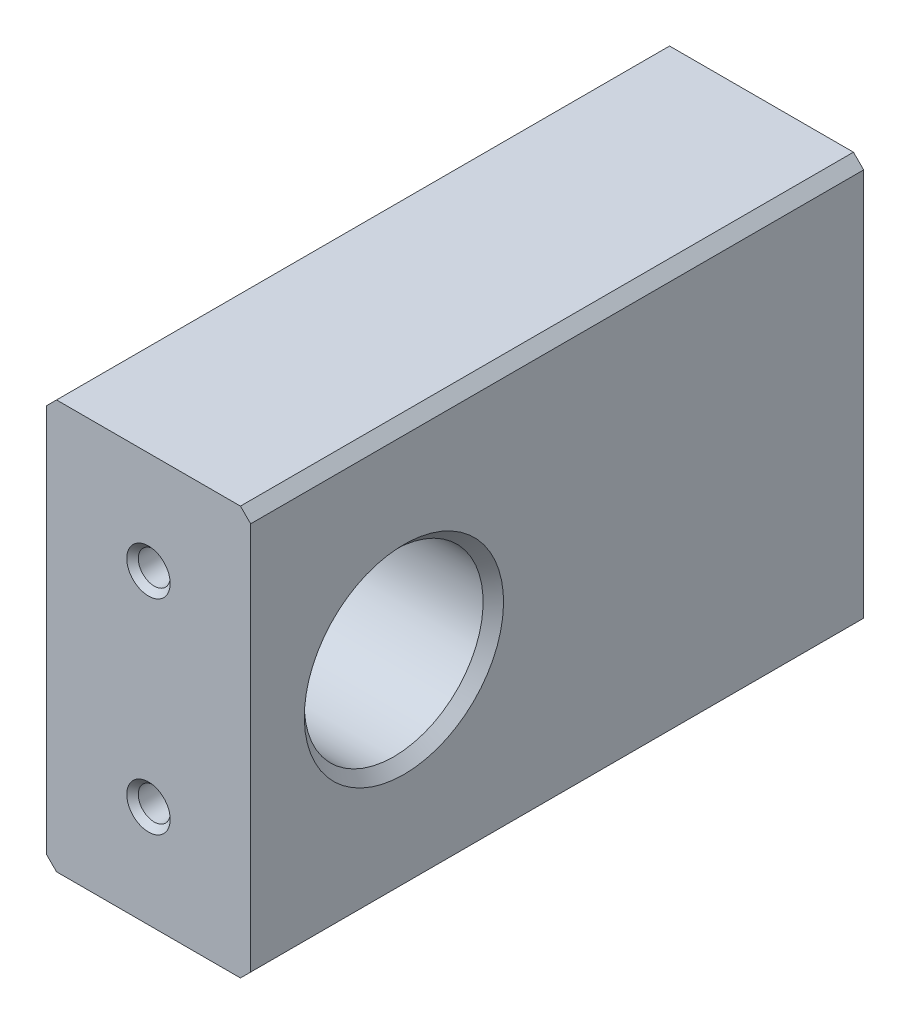
ISO-10303-21;
HEADER;
FILE_DESCRIPTION(('STEP AP214'),'2;1');
FILE_NAME('part.step','',(''),(''),'','','');
FILE_SCHEMA(('AUTOMOTIVE_DESIGN { 1 0 10303 214 1 1 1 1 }'));
ENDSEC;
DATA;
#1=APPLICATION_CONTEXT('core data for automotive mechanical design processes');
#2=APPLICATION_PROTOCOL_DEFINITION('international standard','automotive_design',2000,#1);
#3=PRODUCT_CONTEXT('',#1,'mechanical');
#4=PRODUCT('Part','Part','',(#3));
#5=PRODUCT_RELATED_PRODUCT_CATEGORY('part','',(#4));
#6=PRODUCT_DEFINITION_FORMATION('','',#4);
#7=PRODUCT_DEFINITION_CONTEXT('part definition',#1,'design');
#8=PRODUCT_DEFINITION('design','',#6,#7);
#9=PRODUCT_DEFINITION_SHAPE('','',#8);
#10=(LENGTH_UNIT() NAMED_UNIT(*) SI_UNIT(.MILLI.,.METRE.));
#11=(NAMED_UNIT(*) PLANE_ANGLE_UNIT() SI_UNIT($,.RADIAN.));
#12=(NAMED_UNIT(*) SI_UNIT($,.STERADIAN.) SOLID_ANGLE_UNIT());
#13=UNCERTAINTY_MEASURE_WITH_UNIT(LENGTH_MEASURE(1.E-05),#10,'distance_accuracy_value','');
#14=(GEOMETRIC_REPRESENTATION_CONTEXT(3) GLOBAL_UNCERTAINTY_ASSIGNED_CONTEXT((#13)) GLOBAL_UNIT_ASSIGNED_CONTEXT((#10,
#11,#12)) REPRESENTATION_CONTEXT('',''));
#15=CARTESIAN_POINT('',(0.,0.,0.));
#16=DIRECTION('',(0.,0.,1.));
#17=DIRECTION('',(1.,0.,0.));
#18=AXIS2_PLACEMENT_3D('',#15,#16,#17);
#19=CARTESIAN_POINT('',(50.8,50.8000000000002,152.4));
#20=DIRECTION('',(-1.,0.,0.));
#21=DIRECTION('',(0.,-1.,0.));
#22=AXIS2_PLACEMENT_3D('',#19,#20,#21);
#23=PLANE('',#22);
#24=CARTESIAN_POINT('',(50.8,0.,114.3));
#25=DIRECTION('',(-1.,0.,0.));
#26=DIRECTION('',(0.,-1.,0.));
#27=AXIS2_PLACEMENT_3D('',#24,#25,#26);
#28=CIRCLE('',#27,24.765);
#29=CARTESIAN_POINT('',(50.8,-24.765,114.3));
#30=VERTEX_POINT('',#29);
#31=EDGE_CURVE('E342',#30,#30,#28,.T.);
#32=ORIENTED_EDGE('',*,*,#31,.T.);
#33=EDGE_LOOP('',(#32));
#34=FACE_BOUND('',#33,.T.);
#35=DIRECTION('',(0.,1.,0.));
#36=VECTOR('',#35,1.);
#37=CARTESIAN_POINT('',(50.8,50.8000000000002,152.4));
#38=LINE('',#37,#36);
#39=CARTESIAN_POINT('',(50.8,-48.2600000000002,152.4));
#40=VERTEX_POINT('',#39);
#41=CARTESIAN_POINT('',(50.8,48.2600000000002,152.4));
#42=VERTEX_POINT('',#41);
#43=EDGE_CURVE('E291',#40,#42,#38,.T.);
#44=ORIENTED_EDGE('',*,*,#43,.F.);
#45=DIRECTION('',(0.,0.,-1.));
#46=VECTOR('',#45,1.);
#47=CARTESIAN_POINT('',(50.8,-48.2600000000002,152.4));
#48=LINE('',#47,#46);
#49=CARTESIAN_POINT('',(50.8,-48.2600000000002,0.));
#50=VERTEX_POINT('',#49);
#51=EDGE_CURVE('E174',#40,#50,#48,.T.);
#52=ORIENTED_EDGE('',*,*,#51,.T.);
#53=DIRECTION('',(0.,1.,0.));
#54=VECTOR('',#53,1.);
#55=CARTESIAN_POINT('',(50.8,50.8000000000002,0.));
#56=LINE('',#55,#54);
#57=CARTESIAN_POINT('',(50.8,48.2600000000002,0.));
#58=VERTEX_POINT('',#57);
#59=EDGE_CURVE('E290',#50,#58,#56,.T.);
#60=ORIENTED_EDGE('',*,*,#59,.T.);
#61=DIRECTION('',(0.,0.,1.));
#62=VECTOR('',#61,1.);
#63=CARTESIAN_POINT('',(50.8,48.2600000000002,152.4));
#64=LINE('',#63,#62);
#65=EDGE_CURVE('E340',#58,#42,#64,.T.);
#66=ORIENTED_EDGE('',*,*,#65,.T.);
#67=EDGE_LOOP('',(#44,#52,#60,#66));
#68=FACE_BOUND('',#67,.T.);
#69=ADVANCED_FACE('F166',(#34,#68),#23,.F.);
#70=CARTESIAN_POINT('',(50.8,50.8000000000002,152.4));
#71=DIRECTION('',(0.,-1.,0.));
#72=DIRECTION('',(1.,0.,0.));
#73=AXIS2_PLACEMENT_3D('',#70,#71,#72);
#74=PLANE('',#73);
#75=DIRECTION('',(-1.,0.,0.));
#76=VECTOR('',#75,1.);
#77=CARTESIAN_POINT('',(50.8,50.8000000000002,0.));
#78=LINE('',#77,#76);
#79=CARTESIAN_POINT('',(48.26,50.8000000000002,0.));
#80=VERTEX_POINT('',#79);
#81=CARTESIAN_POINT('',(2.53999999999999,50.8000000000002,0.));
#82=VERTEX_POINT('',#81);
#83=EDGE_CURVE('E305',#80,#82,#78,.T.);
#84=ORIENTED_EDGE('',*,*,#83,.T.);
#85=DIRECTION('',(0.,0.,1.));
#86=VECTOR('',#85,1.);
#87=CARTESIAN_POINT('',(2.53999999999999,50.8000000000002,152.4));
#88=LINE('',#87,#86);
#89=CARTESIAN_POINT('',(2.53999999999999,50.8000000000002,152.4));
#90=VERTEX_POINT('',#89);
#91=EDGE_CURVE('E327',#82,#90,#88,.T.);
#92=ORIENTED_EDGE('',*,*,#91,.T.);
#93=DIRECTION('',(-1.,0.,0.));
#94=VECTOR('',#93,1.);
#95=CARTESIAN_POINT('',(50.8,50.8000000000002,152.4));
#96=LINE('',#95,#94);
#97=CARTESIAN_POINT('',(48.26,50.8000000000002,152.4));
#98=VERTEX_POINT('',#97);
#99=EDGE_CURVE('E294',#98,#90,#96,.T.);
#100=ORIENTED_EDGE('',*,*,#99,.F.);
#101=DIRECTION('',(0.,0.,-1.));
#102=VECTOR('',#101,1.);
#103=CARTESIAN_POINT('',(48.26,50.8000000000002,152.4));
#104=LINE('',#103,#102);
#105=EDGE_CURVE('E324',#98,#80,#104,.T.);
#106=ORIENTED_EDGE('',*,*,#105,.T.);
#107=EDGE_LOOP('',(#84,#92,#100,#106));
#108=FACE_BOUND('',#107,.T.);
#109=ADVANCED_FACE('F362',(#108),#74,.F.);
#110=CARTESIAN_POINT('',(0.,50.8000000000002,152.4));
#111=DIRECTION('',(1.,0.,0.));
#112=DIRECTION('',(0.,1.,0.));
#113=AXIS2_PLACEMENT_3D('',#110,#111,#112);
#114=PLANE('',#113);
#115=CARTESIAN_POINT('',(0.,0.,114.3));
#116=DIRECTION('',(1.,0.,0.));
#117=DIRECTION('',(0.,1.,0.));
#118=AXIS2_PLACEMENT_3D('',#115,#116,#117);
#119=CIRCLE('',#118,22.225);
#120=CARTESIAN_POINT('',(0.,22.2250000000001,114.3));
#121=VERTEX_POINT('',#120);
#122=EDGE_CURVE('E287',#121,#121,#119,.T.);
#123=ORIENTED_EDGE('',*,*,#122,.T.);
#124=EDGE_LOOP('',(#123));
#125=FACE_BOUND('',#124,.T.);
#126=DIRECTION('',(0.,-1.,0.));
#127=VECTOR('',#126,1.);
#128=CARTESIAN_POINT('',(0.,50.8000000000002,152.4));
#129=LINE('',#128,#127);
#130=CARTESIAN_POINT('',(0.,48.2600000000002,152.4));
#131=VERTEX_POINT('',#130);
#132=CARTESIAN_POINT('',(0.,-48.2600000000002,152.4));
#133=VERTEX_POINT('',#132);
#134=EDGE_CURVE('E298',#131,#133,#129,.T.);
#135=ORIENTED_EDGE('',*,*,#134,.F.);
#136=DIRECTION('',(0.,0.,-1.));
#137=VECTOR('',#136,1.);
#138=CARTESIAN_POINT('',(0.,48.2600000000002,152.4));
#139=LINE('',#138,#137);
#140=CARTESIAN_POINT('',(0.,48.2600000000002,0.));
#141=VERTEX_POINT('',#140);
#142=EDGE_CURVE('E313',#131,#141,#139,.T.);
#143=ORIENTED_EDGE('',*,*,#142,.T.);
#144=DIRECTION('',(0.,-1.,0.));
#145=VECTOR('',#144,1.);
#146=CARTESIAN_POINT('',(0.,50.8000000000002,0.));
#147=LINE('',#146,#145);
#148=CARTESIAN_POINT('',(0.,-48.2600000000002,0.));
#149=VERTEX_POINT('',#148);
#150=EDGE_CURVE('E308',#141,#149,#147,.T.);
#151=ORIENTED_EDGE('',*,*,#150,.T.);
#152=DIRECTION('',(0.,0.,1.));
#153=VECTOR('',#152,1.);
#154=CARTESIAN_POINT('',(0.,-48.2600000000002,152.4));
#155=LINE('',#154,#153);
#156=EDGE_CURVE('E302',#149,#133,#155,.T.);
#157=ORIENTED_EDGE('',*,*,#156,.T.);
#158=EDGE_LOOP('',(#135,#143,#151,#157));
#159=FACE_BOUND('',#158,.T.);
#160=ADVANCED_FACE('F371',(#125,#159),#114,.F.);
#161=CARTESIAN_POINT('',(50.8,-50.8000000000002,152.4));
#162=DIRECTION('',(0.,1.,0.));
#163=DIRECTION('',(-1.,0.,0.));
#164=AXIS2_PLACEMENT_3D('',#161,#162,#163);
#165=PLANE('',#164);
#166=DIRECTION('',(1.,0.,0.));
#167=VECTOR('',#166,1.);
#168=CARTESIAN_POINT('',(50.8,-50.8000000000002,152.4));
#169=LINE('',#168,#167);
#170=CARTESIAN_POINT('',(2.53999999999999,-50.8000000000002,152.4));
#171=VERTEX_POINT('',#170);
#172=CARTESIAN_POINT('',(48.26,-50.8000000000002,152.4));
#173=VERTEX_POINT('',#172);
#174=EDGE_CURVE('E300',#171,#173,#169,.T.);
#175=ORIENTED_EDGE('',*,*,#174,.F.);
#176=DIRECTION('',(0.,0.,-1.));
#177=VECTOR('',#176,1.);
#178=CARTESIAN_POINT('',(2.53999999999999,-50.8000000000002,152.4));
#179=LINE('',#178,#177);
#180=CARTESIAN_POINT('',(2.53999999999999,-50.8000000000002,0.));
#181=VERTEX_POINT('',#180);
#182=EDGE_CURVE('E337',#171,#181,#179,.T.);
#183=ORIENTED_EDGE('',*,*,#182,.T.);
#184=DIRECTION('',(1.,0.,0.));
#185=VECTOR('',#184,1.);
#186=CARTESIAN_POINT('',(50.8,-50.8000000000002,0.));
#187=LINE('',#186,#185);
#188=CARTESIAN_POINT('',(48.26,-50.8000000000002,0.));
#189=VERTEX_POINT('',#188);
#190=EDGE_CURVE('E295',#181,#189,#187,.T.);
#191=ORIENTED_EDGE('',*,*,#190,.T.);
#192=DIRECTION('',(0.,0.,1.));
#193=VECTOR('',#192,1.);
#194=CARTESIAN_POINT('',(48.26,-50.8000000000002,152.4));
#195=LINE('',#194,#193);
#196=EDGE_CURVE('E181',#189,#173,#195,.T.);
#197=ORIENTED_EDGE('',*,*,#196,.T.);
#198=EDGE_LOOP('',(#175,#183,#191,#197));
#199=FACE_BOUND('',#198,.T.);
#200=ADVANCED_FACE('F376',(#199),#165,.F.);
#201=CARTESIAN_POINT('',(50.8,-50.8000000000002,152.4));
#202=DIRECTION('',(0.,0.,-1.));
#203=DIRECTION('',(-1.,0.,0.));
#204=AXIS2_PLACEMENT_3D('',#201,#202,#203);
#205=PLANE('',#204);
#206=CARTESIAN_POINT('',(25.4,-25.4000000000001,152.4));
#207=DIRECTION('',(0.,0.,1.));
#208=DIRECTION('',(1.,0.,0.));
#209=AXIS2_PLACEMENT_3D('',#206,#207,#208);
#210=CIRCLE('',#209,5.3975);
#211=CARTESIAN_POINT('',(30.7975,-25.4000000000001,152.4));
#212=VERTEX_POINT('',#211);
#213=EDGE_CURVE('E260',#212,#212,#210,.T.);
#214=ORIENTED_EDGE('',*,*,#213,.F.);
#215=EDGE_LOOP('',(#214));
#216=FACE_BOUND('',#215,.T.);
#217=CARTESIAN_POINT('',(25.4,25.4000000000001,152.4));
#218=DIRECTION('',(0.,0.,1.));
#219=DIRECTION('',(1.,0.,0.));
#220=AXIS2_PLACEMENT_3D('',#217,#218,#219);
#221=CIRCLE('',#220,5.3975);
#222=CARTESIAN_POINT('',(30.7975,25.4000000000001,152.4));
#223=VERTEX_POINT('',#222);
#224=EDGE_CURVE('E253',#223,#223,#221,.T.);
#225=ORIENTED_EDGE('',*,*,#224,.F.);
#226=EDGE_LOOP('',(#225));
#227=FACE_BOUND('',#226,.T.);
#228=ORIENTED_EDGE('',*,*,#99,.T.);
#229=DIRECTION('',(0.707106781186549,0.707106781186549,0.));
#230=VECTOR('',#229,1.);
#231=CARTESIAN_POINT('',(0.,48.2600000000002,152.4));
#232=LINE('',#231,#230);
#233=EDGE_CURVE('E334',#90,#131,#232,.F.);
#234=ORIENTED_EDGE('',*,*,#233,.T.);
#235=ORIENTED_EDGE('',*,*,#134,.T.);
#236=DIRECTION('',(-0.707106781186547,0.707106781186551,0.));
#237=VECTOR('',#236,1.);
#238=CARTESIAN_POINT('',(2.53999999999999,-50.8000000000002,152.4));
#239=LINE('',#238,#237);
#240=EDGE_CURVE('E188',#133,#171,#239,.F.);
#241=ORIENTED_EDGE('',*,*,#240,.T.);
#242=ORIENTED_EDGE('',*,*,#174,.T.);
#243=DIRECTION('',(-0.707106781186553,-0.707106781186545,0.));
#244=VECTOR('',#243,1.);
#245=CARTESIAN_POINT('',(50.8,-48.2600000000002,152.4));
#246=LINE('',#245,#244);
#247=EDGE_CURVE('E331',#173,#40,#246,.F.);
#248=ORIENTED_EDGE('',*,*,#247,.T.);
#249=ORIENTED_EDGE('',*,*,#43,.T.);
#250=DIRECTION('',(0.707106781186545,-0.707106781186553,0.));
#251=VECTOR('',#250,1.);
#252=CARTESIAN_POINT('',(48.26,50.8000000000002,152.4));
#253=LINE('',#252,#251);
#254=EDGE_CURVE('E329',#42,#98,#253,.F.);
#255=ORIENTED_EDGE('',*,*,#254,.T.);
#256=EDGE_LOOP('',(#228,#234,#235,#241,#242,#248,#249,#255));
#257=FACE_BOUND('',#256,.T.);
#258=ADVANCED_FACE('F365',(#216,#227,#257),#205,.F.);
#259=CARTESIAN_POINT('',(50.8,-50.8000000000002,0.));
#260=DIRECTION('',(0.,0.,-1.));
#261=DIRECTION('',(-1.,0.,0.));
#262=AXIS2_PLACEMENT_3D('',#259,#260,#261);
#263=PLANE('',#262);
#264=CARTESIAN_POINT('',(25.4,-25.4000000000001,0.));
#265=DIRECTION('',(0.,0.,-1.));
#266=DIRECTION('',(-1.,0.,0.));
#267=AXIS2_PLACEMENT_3D('',#264,#265,#266);
#268=CIRCLE('',#267,5.3975);
#269=CARTESIAN_POINT('',(20.0025,-25.4000000000001,0.));
#270=VERTEX_POINT('',#269);
#271=EDGE_CURVE('E269',#270,#270,#268,.T.);
#272=ORIENTED_EDGE('',*,*,#271,.F.);
#273=EDGE_LOOP('',(#272));
#274=FACE_BOUND('',#273,.T.);
#275=CARTESIAN_POINT('',(25.4,25.4000000000001,0.));
#276=DIRECTION('',(0.,0.,-1.));
#277=DIRECTION('',(-1.,0.,0.));
#278=AXIS2_PLACEMENT_3D('',#275,#276,#277);
#279=CIRCLE('',#278,5.3975);
#280=CARTESIAN_POINT('',(20.0025,25.4000000000001,0.));
#281=VERTEX_POINT('',#280);
#282=EDGE_CURVE('E278',#281,#281,#279,.T.);
#283=ORIENTED_EDGE('',*,*,#282,.F.);
#284=EDGE_LOOP('',(#283));
#285=FACE_BOUND('',#284,.T.);
#286=ORIENTED_EDGE('',*,*,#150,.F.);
#287=DIRECTION('',(-0.707106781186549,-0.707106781186549,0.));
#288=VECTOR('',#287,1.);
#289=CARTESIAN_POINT('',(-24.13,24.1300000000001,0.));
#290=LINE('',#289,#288);
#291=EDGE_CURVE('E322',#141,#82,#290,.F.);
#292=ORIENTED_EDGE('',*,*,#291,.T.);
#293=ORIENTED_EDGE('',*,*,#83,.F.);
#294=DIRECTION('',(-0.707106781186545,0.707106781186553,0.));
#295=VECTOR('',#294,1.);
#296=CARTESIAN_POINT('',(100.33,-1.27000000000053,0.));
#297=LINE('',#296,#295);
#298=EDGE_CURVE('E316',#80,#58,#297,.F.);
#299=ORIENTED_EDGE('',*,*,#298,.T.);
#300=ORIENTED_EDGE('',*,*,#59,.F.);
#301=DIRECTION('',(0.707106781186553,0.707106781186545,0.));
#302=VECTOR('',#301,1.);
#303=CARTESIAN_POINT('',(49.53,-49.5300000000002,0.));
#304=LINE('',#303,#302);
#305=EDGE_CURVE('E318',#50,#189,#304,.F.);
#306=ORIENTED_EDGE('',*,*,#305,.T.);
#307=ORIENTED_EDGE('',*,*,#190,.F.);
#308=DIRECTION('',(0.707106781186547,-0.707106781186551,0.));
#309=VECTOR('',#308,1.);
#310=CARTESIAN_POINT('',(26.6699999999999,-74.9300000000002,0.));
#311=LINE('',#310,#309);
#312=EDGE_CURVE('E320',#181,#149,#311,.F.);
#313=ORIENTED_EDGE('',*,*,#312,.T.);
#314=EDGE_LOOP('',(#286,#292,#293,#299,#300,#306,#307,#313));
#315=FACE_BOUND('',#314,.T.);
#316=ADVANCED_FACE('F354',(#274,#285,#315),#263,.T.);
#317=CARTESIAN_POINT('',(0.,0.,114.3));
#318=DIRECTION('',(1.,0.,0.));
#319=DIRECTION('',(0.,1.,0.));
#320=AXIS2_PLACEMENT_3D('',#317,#318,#319);
#321=CYLINDRICAL_SURFACE('',#320,22.225);
#322=CARTESIAN_POINT('',(48.26,0.,114.3));
#323=DIRECTION('',(-1.,0.,0.));
#324=DIRECTION('',(0.,-1.,0.));
#325=AXIS2_PLACEMENT_3D('',#322,#323,#324);
#326=CIRCLE('',#325,22.225);
#327=CARTESIAN_POINT('',(48.26,-22.2250000000001,114.3));
#328=VERTEX_POINT('',#327);
#329=EDGE_CURVE('E12',#328,#328,#326,.F.);
#330=ORIENTED_EDGE('',*,*,#329,.T.);
#331=EDGE_LOOP('',(#330));
#332=FACE_BOUND('',#331,.T.);
#333=ORIENTED_EDGE('',*,*,#122,.F.);
#334=EDGE_LOOP('',(#333));
#335=FACE_BOUND('',#334,.T.);
#336=ADVANCED_FACE('F397',(#332,#335),#321,.F.);
#337=CARTESIAN_POINT('',(0.,48.2600000000002,152.4));
#338=DIRECTION('',(0.707106781186549,-0.707106781186549,0.));
#339=DIRECTION('',(0.707106781186549,0.707106781186549,0.));
#340=AXIS2_PLACEMENT_3D('',#337,#338,#339);
#341=PLANE('',#340);
#342=ORIENTED_EDGE('',*,*,#233,.F.);
#343=ORIENTED_EDGE('',*,*,#91,.F.);
#344=ORIENTED_EDGE('',*,*,#291,.F.);
#345=ORIENTED_EDGE('',*,*,#142,.F.);
#346=EDGE_LOOP('',(#342,#343,#344,#345));
#347=FACE_BOUND('',#346,.T.);
#348=ADVANCED_FACE('F369',(#347),#341,.F.);
#349=CARTESIAN_POINT('',(2.53999999999999,-50.8000000000002,152.4));
#350=DIRECTION('',(0.707106781186551,0.707106781186547,0.));
#351=DIRECTION('',(-0.707106781186547,0.707106781186551,0.));
#352=AXIS2_PLACEMENT_3D('',#349,#350,#351);
#353=PLANE('',#352);
#354=ORIENTED_EDGE('',*,*,#240,.F.);
#355=ORIENTED_EDGE('',*,*,#156,.F.);
#356=ORIENTED_EDGE('',*,*,#312,.F.);
#357=ORIENTED_EDGE('',*,*,#182,.F.);
#358=EDGE_LOOP('',(#354,#355,#356,#357));
#359=FACE_BOUND('',#358,.T.);
#360=ADVANCED_FACE('F375',(#359),#353,.F.);
#361=CARTESIAN_POINT('',(50.8,-48.2600000000002,152.4));
#362=DIRECTION('',(-0.707106781186545,0.707106781186553,0.));
#363=DIRECTION('',(-0.707106781186553,-0.707106781186545,0.));
#364=AXIS2_PLACEMENT_3D('',#361,#362,#363);
#365=PLANE('',#364);
#366=ORIENTED_EDGE('',*,*,#247,.F.);
#367=ORIENTED_EDGE('',*,*,#196,.F.);
#368=ORIENTED_EDGE('',*,*,#305,.F.);
#369=ORIENTED_EDGE('',*,*,#51,.F.);
#370=EDGE_LOOP('',(#366,#367,#368,#369));
#371=FACE_BOUND('',#370,.T.);
#372=ADVANCED_FACE('F377',(#371),#365,.F.);
#373=CARTESIAN_POINT('',(48.26,0.,114.3));
#374=DIRECTION('',(1.,0.,0.));
#375=DIRECTION('',(0.,1.,0.));
#376=AXIS2_PLACEMENT_3D('',#373,#374,#375);
#377=CONICAL_SURFACE('',#376,22.225,0.785398163397447);
#378=ORIENTED_EDGE('',*,*,#31,.F.);
#379=EDGE_LOOP('',(#378));
#380=FACE_BOUND('',#379,.T.);
#381=ORIENTED_EDGE('',*,*,#329,.F.);
#382=EDGE_LOOP('',(#381));
#383=FACE_BOUND('',#382,.T.);
#384=ADVANCED_FACE('F379',(#380,#383),#377,.F.);
#385=CARTESIAN_POINT('',(48.26,50.8000000000002,152.4));
#386=DIRECTION('',(-0.707106781186553,-0.707106781186545,0.));
#387=DIRECTION('',(0.707106781186545,-0.707106781186553,0.));
#388=AXIS2_PLACEMENT_3D('',#385,#386,#387);
#389=PLANE('',#388);
#390=ORIENTED_EDGE('',*,*,#254,.F.);
#391=ORIENTED_EDGE('',*,*,#65,.F.);
#392=ORIENTED_EDGE('',*,*,#298,.F.);
#393=ORIENTED_EDGE('',*,*,#105,.F.);
#394=EDGE_LOOP('',(#390,#391,#392,#393));
#395=FACE_BOUND('',#394,.T.);
#396=ADVANCED_FACE('F168',(#395),#389,.F.);
#397=CARTESIAN_POINT('',(25.4,25.4000000000001,23.876));
#398=DIRECTION('',(0.,0.,-1.));
#399=DIRECTION('',(-1.,0.,0.));
#400=AXIS2_PLACEMENT_3D('',#397,#398,#399);
#401=CONICAL_SURFACE('',#400,3.96875,1.02974425867665);
#402=CARTESIAN_POINT('',(25.4,25.4000000000001,26.2606655817656));
#403=VERTEX_POINT('',#402);
#404=VERTEX_LOOP('',#403);
#405=FACE_BOUND('',#404,.T.);
#406=CARTESIAN_POINT('',(25.4,25.4000000000001,23.876));
#407=DIRECTION('',(0.,0.,-1.));
#408=DIRECTION('',(-1.,0.,0.));
#409=AXIS2_PLACEMENT_3D('',#406,#407,#408);
#410=CIRCLE('',#409,3.96875);
#411=CARTESIAN_POINT('',(21.43125,25.4000000000001,23.876));
#412=VERTEX_POINT('',#411);
#413=EDGE_CURVE('E284',#412,#412,#410,.T.);
#414=ORIENTED_EDGE('',*,*,#413,.T.);
#415=EDGE_LOOP('',(#414));
#416=FACE_BOUND('',#415,.T.);
#417=ADVANCED_FACE('F411',(#405,#416),#401,.F.);
#418=CARTESIAN_POINT('',(25.4,25.4000000000001,0.));
#419=DIRECTION('',(0.,0.,-1.));
#420=DIRECTION('',(-1.,0.,0.));
#421=AXIS2_PLACEMENT_3D('',#418,#419,#420);
#422=CYLINDRICAL_SURFACE('',#421,3.96875);
#423=ORIENTED_EDGE('',*,*,#413,.F.);
#424=EDGE_LOOP('',(#423));
#425=FACE_BOUND('',#424,.T.);
#426=CARTESIAN_POINT('',(25.4,25.4000000000001,1.42875000000001));
#427=DIRECTION('',(0.,0.,-1.));
#428=DIRECTION('',(-1.,0.,0.));
#429=AXIS2_PLACEMENT_3D('',#426,#427,#428);
#430=CIRCLE('',#429,3.96875);
#431=CARTESIAN_POINT('',(21.43125,25.4000000000001,1.42875000000001));
#432=VERTEX_POINT('',#431);
#433=EDGE_CURVE('E281',#432,#432,#430,.T.);
#434=ORIENTED_EDGE('',*,*,#433,.T.);
#435=EDGE_LOOP('',(#434));
#436=FACE_BOUND('',#435,.T.);
#437=ADVANCED_FACE('F476',(#425,#436),#422,.F.);
#438=CARTESIAN_POINT('',(25.4,25.4000000000001,0.));
#439=DIRECTION('',(0.,0.,-1.));
#440=DIRECTION('',(-1.,0.,0.));
#441=AXIS2_PLACEMENT_3D('',#438,#439,#440);
#442=CONICAL_SURFACE('',#441,5.3975,0.78539816339745);
#443=ORIENTED_EDGE('',*,*,#433,.F.);
#444=EDGE_LOOP('',(#443));
#445=FACE_BOUND('',#444,.T.);
#446=ORIENTED_EDGE('',*,*,#282,.T.);
#447=EDGE_LOOP('',(#446));
#448=FACE_BOUND('',#447,.T.);
#449=ADVANCED_FACE('F486',(#445,#448),#442,.F.);
#450=CARTESIAN_POINT('',(25.4,-25.4000000000001,23.876));
#451=DIRECTION('',(0.,0.,-1.));
#452=DIRECTION('',(-1.,0.,0.));
#453=AXIS2_PLACEMENT_3D('',#450,#451,#452);
#454=CONICAL_SURFACE('',#453,3.96875,1.02974425867665);
#455=CARTESIAN_POINT('',(25.4,-25.4000000000001,26.2606655817656));
#456=VERTEX_POINT('',#455);
#457=VERTEX_LOOP('',#456);
#458=FACE_BOUND('',#457,.T.);
#459=CARTESIAN_POINT('',(25.4,-25.4000000000001,23.876));
#460=DIRECTION('',(0.,0.,-1.));
#461=DIRECTION('',(-1.,0.,0.));
#462=AXIS2_PLACEMENT_3D('',#459,#460,#461);
#463=CIRCLE('',#462,3.96875);
#464=CARTESIAN_POINT('',(21.43125,-25.4000000000001,23.876));
#465=VERTEX_POINT('',#464);
#466=EDGE_CURVE('E275',#465,#465,#463,.T.);
#467=ORIENTED_EDGE('',*,*,#466,.T.);
#468=EDGE_LOOP('',(#467));
#469=FACE_BOUND('',#468,.T.);
#470=ADVANCED_FACE('F496',(#458,#469),#454,.F.);
#471=CARTESIAN_POINT('',(25.4,-25.4000000000001,0.));
#472=DIRECTION('',(0.,0.,-1.));
#473=DIRECTION('',(-1.,0.,0.));
#474=AXIS2_PLACEMENT_3D('',#471,#472,#473);
#475=CYLINDRICAL_SURFACE('',#474,3.96875);
#476=ORIENTED_EDGE('',*,*,#466,.F.);
#477=EDGE_LOOP('',(#476));
#478=FACE_BOUND('',#477,.T.);
#479=CARTESIAN_POINT('',(25.4,-25.4000000000001,1.42875000000001));
#480=DIRECTION('',(0.,0.,-1.));
#481=DIRECTION('',(-1.,0.,0.));
#482=AXIS2_PLACEMENT_3D('',#479,#480,#481);
#483=CIRCLE('',#482,3.96875);
#484=CARTESIAN_POINT('',(21.43125,-25.4000000000001,1.42875000000001));
#485=VERTEX_POINT('',#484);
#486=EDGE_CURVE('E272',#485,#485,#483,.T.);
#487=ORIENTED_EDGE('',*,*,#486,.T.);
#488=EDGE_LOOP('',(#487));
#489=FACE_BOUND('',#488,.T.);
#490=ADVANCED_FACE('F506',(#478,#489),#475,.F.);
#491=CARTESIAN_POINT('',(25.4,-25.4000000000001,0.));
#492=DIRECTION('',(0.,0.,-1.));
#493=DIRECTION('',(-1.,0.,0.));
#494=AXIS2_PLACEMENT_3D('',#491,#492,#493);
#495=CONICAL_SURFACE('',#494,5.3975,0.78539816339745);
#496=ORIENTED_EDGE('',*,*,#486,.F.);
#497=EDGE_LOOP('',(#496));
#498=FACE_BOUND('',#497,.T.);
#499=ORIENTED_EDGE('',*,*,#271,.T.);
#500=EDGE_LOOP('',(#499));
#501=FACE_BOUND('',#500,.T.);
#502=ADVANCED_FACE('F517',(#498,#501),#495,.F.);
#503=CARTESIAN_POINT('',(25.4,25.4000000000001,128.524));
#504=DIRECTION('',(0.,0.,1.));
#505=DIRECTION('',(1.,0.,0.));
#506=AXIS2_PLACEMENT_3D('',#503,#504,#505);
#507=CONICAL_SURFACE('',#506,3.96875,1.02974425867666);
#508=CARTESIAN_POINT('',(25.4,25.4000000000001,126.139334418234));
#509=VERTEX_POINT('',#508);
#510=VERTEX_LOOP('',#509);
#511=FACE_BOUND('',#510,.T.);
#512=CARTESIAN_POINT('',(25.4,25.4000000000001,128.524));
#513=DIRECTION('',(0.,0.,1.));
#514=DIRECTION('',(1.,0.,0.));
#515=AXIS2_PLACEMENT_3D('',#512,#513,#514);
#516=CIRCLE('',#515,3.96875);
#517=CARTESIAN_POINT('',(29.36875,25.4000000000001,128.524));
#518=VERTEX_POINT('',#517);
#519=EDGE_CURVE('E266',#518,#518,#516,.T.);
#520=ORIENTED_EDGE('',*,*,#519,.T.);
#521=EDGE_LOOP('',(#520));
#522=FACE_BOUND('',#521,.T.);
#523=ADVANCED_FACE('F528',(#511,#522),#507,.F.);
#524=CARTESIAN_POINT('',(25.4,25.4000000000001,152.4));
#525=DIRECTION('',(0.,0.,1.));
#526=DIRECTION('',(1.,0.,0.));
#527=AXIS2_PLACEMENT_3D('',#524,#525,#526);
#528=CYLINDRICAL_SURFACE('',#527,3.96875);
#529=ORIENTED_EDGE('',*,*,#519,.F.);
#530=EDGE_LOOP('',(#529));
#531=FACE_BOUND('',#530,.T.);
#532=CARTESIAN_POINT('',(25.4,25.4000000000001,150.97125));
#533=DIRECTION('',(0.,0.,1.));
#534=DIRECTION('',(1.,0.,0.));
#535=AXIS2_PLACEMENT_3D('',#532,#533,#534);
#536=CIRCLE('',#535,3.96875);
#537=CARTESIAN_POINT('',(29.36875,25.4000000000001,150.97125));
#538=VERTEX_POINT('',#537);
#539=EDGE_CURVE('E257',#538,#538,#536,.T.);
#540=ORIENTED_EDGE('',*,*,#539,.T.);
#541=EDGE_LOOP('',(#540));
#542=FACE_BOUND('',#541,.T.);
#543=ADVANCED_FACE('F538',(#531,#542),#528,.F.);
#544=CARTESIAN_POINT('',(25.4,25.4000000000001,152.4));
#545=DIRECTION('',(0.,0.,1.));
#546=DIRECTION('',(1.,0.,0.));
#547=AXIS2_PLACEMENT_3D('',#544,#545,#546);
#548=CONICAL_SURFACE('',#547,5.3975,0.785398163397447);
#549=ORIENTED_EDGE('',*,*,#539,.F.);
#550=EDGE_LOOP('',(#549));
#551=FACE_BOUND('',#550,.T.);
#552=ORIENTED_EDGE('',*,*,#224,.T.);
#553=EDGE_LOOP('',(#552));
#554=FACE_BOUND('',#553,.T.);
#555=ADVANCED_FACE('F247',(#551,#554),#548,.F.);
#556=CARTESIAN_POINT('',(25.4,-25.4000000000001,128.524));
#557=DIRECTION('',(0.,0.,1.));
#558=DIRECTION('',(1.,0.,0.));
#559=AXIS2_PLACEMENT_3D('',#556,#557,#558);
#560=CONICAL_SURFACE('',#559,3.96875,1.02974425867666);
#561=CARTESIAN_POINT('',(25.4,-25.4000000000001,126.139334418234));
#562=VERTEX_POINT('',#561);
#563=VERTEX_LOOP('',#562);
#564=FACE_BOUND('',#563,.T.);
#565=CARTESIAN_POINT('',(25.4,-25.4000000000001,128.524));
#566=DIRECTION('',(0.,0.,1.));
#567=DIRECTION('',(1.,0.,0.));
#568=AXIS2_PLACEMENT_3D('',#565,#566,#567);
#569=CIRCLE('',#568,3.96875);
#570=CARTESIAN_POINT('',(29.36875,-25.4000000000001,128.524));
#571=VERTEX_POINT('',#570);
#572=EDGE_CURVE('E251',#571,#571,#569,.T.);
#573=ORIENTED_EDGE('',*,*,#572,.T.);
#574=EDGE_LOOP('',(#573));
#575=FACE_BOUND('',#574,.T.);
#576=ADVANCED_FACE('F243',(#564,#575),#560,.F.);
#577=CARTESIAN_POINT('',(25.4,-25.4000000000001,152.4));
#578=DIRECTION('',(0.,0.,1.));
#579=DIRECTION('',(1.,0.,0.));
#580=AXIS2_PLACEMENT_3D('',#577,#578,#579);
#581=CYLINDRICAL_SURFACE('',#580,3.96875);
#582=ORIENTED_EDGE('',*,*,#572,.F.);
#583=EDGE_LOOP('',(#582));
#584=FACE_BOUND('',#583,.T.);
#585=CARTESIAN_POINT('',(25.4,-25.4000000000001,150.97125));
#586=DIRECTION('',(0.,0.,1.));
#587=DIRECTION('',(1.,0.,0.));
#588=AXIS2_PLACEMENT_3D('',#585,#586,#587);
#589=CIRCLE('',#588,3.96875);
#590=CARTESIAN_POINT('',(29.36875,-25.4000000000001,150.97125));
#591=VERTEX_POINT('',#590);
#592=EDGE_CURVE('E254',#591,#591,#589,.T.);
#593=ORIENTED_EDGE('',*,*,#592,.T.);
#594=EDGE_LOOP('',(#593));
#595=FACE_BOUND('',#594,.T.);
#596=ADVANCED_FACE('F246',(#584,#595),#581,.F.);
#597=CARTESIAN_POINT('',(25.4,-25.4000000000001,152.4));
#598=DIRECTION('',(0.,0.,1.));
#599=DIRECTION('',(1.,0.,0.));
#600=AXIS2_PLACEMENT_3D('',#597,#598,#599);
#601=CONICAL_SURFACE('',#600,5.3975,0.785398163397447);
#602=ORIENTED_EDGE('',*,*,#592,.F.);
#603=EDGE_LOOP('',(#602));
#604=FACE_BOUND('',#603,.T.);
#605=ORIENTED_EDGE('',*,*,#213,.T.);
#606=EDGE_LOOP('',(#605));
#607=FACE_BOUND('',#606,.T.);
#608=ADVANCED_FACE('F572',(#604,#607),#601,.F.);
#609=CLOSED_SHELL('',(#69,#109,#160,#200,#258,#316,#336,#348,#360,#372,#384,#396,#417,#437,#449,
#470,#490,#502,#523,#543,#555,#576,#596,#608));
#610=MANIFOLD_SOLID_BREP('B2',#609);
#611=ADVANCED_BREP_SHAPE_REPRESENTATION('',(#18,#610),#14);
#612=SHAPE_DEFINITION_REPRESENTATION(#9,#611);
ENDSEC;
END-ISO-10303-21;
